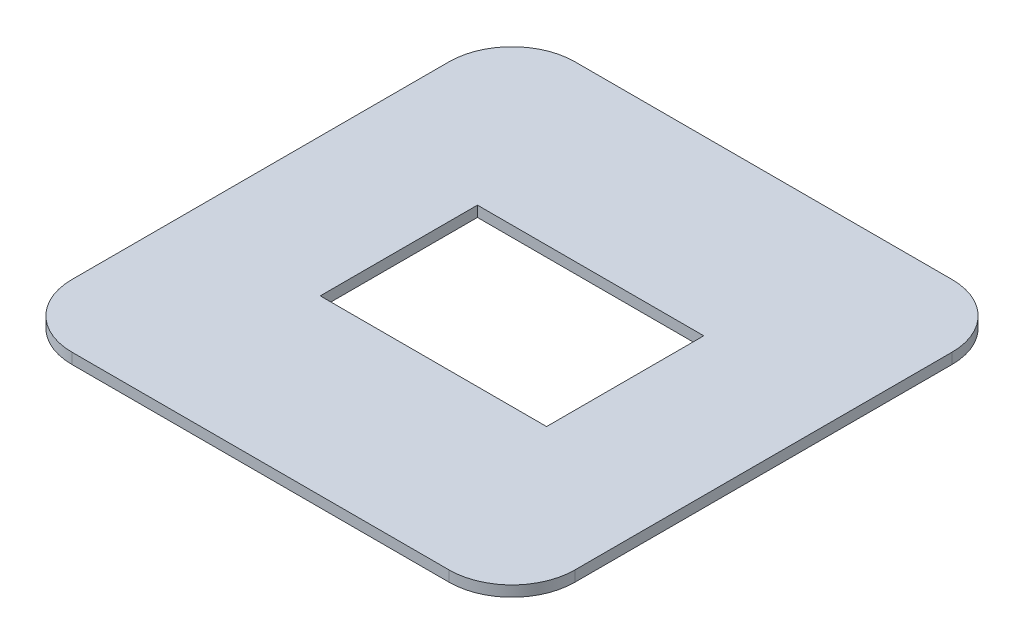
ISO-10303-21;
HEADER;
FILE_DESCRIPTION(('STEP AP214'),'2;1');
FILE_NAME('part.step','',(''),(''),'','','');
FILE_SCHEMA(('AUTOMOTIVE_DESIGN { 1 0 10303 214 1 1 1 1 }'));
ENDSEC;
DATA;
#1=APPLICATION_CONTEXT('core data for automotive mechanical design processes');
#2=APPLICATION_PROTOCOL_DEFINITION('international standard','automotive_design',2000,#1);
#3=PRODUCT_CONTEXT('',#1,'mechanical');
#4=PRODUCT('Part','Part','',(#3));
#5=PRODUCT_RELATED_PRODUCT_CATEGORY('part','',(#4));
#6=PRODUCT_DEFINITION_FORMATION('','',#4);
#7=PRODUCT_DEFINITION_CONTEXT('part definition',#1,'design');
#8=PRODUCT_DEFINITION('design','',#6,#7);
#9=PRODUCT_DEFINITION_SHAPE('','',#8);
#10=(LENGTH_UNIT() NAMED_UNIT(*) SI_UNIT(.MILLI.,.METRE.));
#11=(NAMED_UNIT(*) PLANE_ANGLE_UNIT() SI_UNIT($,.RADIAN.));
#12=(NAMED_UNIT(*) SI_UNIT($,.STERADIAN.) SOLID_ANGLE_UNIT());
#13=UNCERTAINTY_MEASURE_WITH_UNIT(LENGTH_MEASURE(1.E-05),#10,'distance_accuracy_value','');
#14=(GEOMETRIC_REPRESENTATION_CONTEXT(3) GLOBAL_UNCERTAINTY_ASSIGNED_CONTEXT((#13)) GLOBAL_UNIT_ASSIGNED_CONTEXT((#10,
#11,#12)) REPRESENTATION_CONTEXT('',''));
#15=CARTESIAN_POINT('',(0.,0.,0.));
#16=DIRECTION('',(0.,0.,1.));
#17=DIRECTION('',(1.,0.,0.));
#18=AXIS2_PLACEMENT_3D('',#15,#16,#17);
#19=CARTESIAN_POINT('',(-40.,1.7,-40.));
#20=DIRECTION('',(0.,0.,-1.));
#21=DIRECTION('',(-1.,0.,0.));
#22=AXIS2_PLACEMENT_3D('',#19,#20,#21);
#23=PLANE('',#22);
#24=DIRECTION('',(1.,0.,0.));
#25=VECTOR('',#24,1.);
#26=CARTESIAN_POINT('',(-40.,0.,-40.));
#27=LINE('',#26,#25);
#28=CARTESIAN_POINT('',(-30.,0.,-40.));
#29=VERTEX_POINT('',#28);
#30=CARTESIAN_POINT('',(30.,0.,-40.));
#31=VERTEX_POINT('',#30);
#32=EDGE_CURVE('E207',#29,#31,#27,.T.);
#33=ORIENTED_EDGE('',*,*,#32,.F.);
#34=DIRECTION('',(0.,-1.,0.));
#35=VECTOR('',#34,1.);
#36=CARTESIAN_POINT('',(-30.,1.7,-40.));
#37=LINE('',#36,#35);
#38=CARTESIAN_POINT('',(-30.,1.7,-40.));
#39=VERTEX_POINT('',#38);
#40=EDGE_CURVE('E264',#29,#39,#37,.F.);
#41=ORIENTED_EDGE('',*,*,#40,.T.);
#42=DIRECTION('',(1.,0.,0.));
#43=VECTOR('',#42,1.);
#44=CARTESIAN_POINT('',(-40.,1.7,-40.));
#45=LINE('',#44,#43);
#46=CARTESIAN_POINT('',(30.,1.7,-40.));
#47=VERTEX_POINT('',#46);
#48=EDGE_CURVE('E213',#39,#47,#45,.T.);
#49=ORIENTED_EDGE('',*,*,#48,.T.);
#50=DIRECTION('',(0.,-1.,0.));
#51=VECTOR('',#50,1.);
#52=CARTESIAN_POINT('',(30.,0.,-40.));
#53=LINE('',#52,#51);
#54=EDGE_CURVE('E260',#47,#31,#53,.T.);
#55=ORIENTED_EDGE('',*,*,#54,.T.);
#56=EDGE_LOOP('',(#33,#41,#49,#55));
#57=FACE_BOUND('',#56,.T.);
#58=ADVANCED_FACE('F67',(#57),#23,.T.);
#59=CARTESIAN_POINT('',(-40.,1.7,40.));
#60=DIRECTION('',(-1.,0.,0.));
#61=DIRECTION('',(0.,0.,1.));
#62=AXIS2_PLACEMENT_3D('',#59,#60,#61);
#63=PLANE('',#62);
#64=DIRECTION('',(0.,0.,-1.));
#65=VECTOR('',#64,1.);
#66=CARTESIAN_POINT('',(-40.,1.7,40.));
#67=LINE('',#66,#65);
#68=CARTESIAN_POINT('',(-40.,1.7,30.));
#69=VERTEX_POINT('',#68);
#70=CARTESIAN_POINT('',(-40.,1.7,-30.));
#71=VERTEX_POINT('',#70);
#72=EDGE_CURVE('E224',#69,#71,#67,.T.);
#73=ORIENTED_EDGE('',*,*,#72,.T.);
#74=DIRECTION('',(0.,-1.,0.));
#75=VECTOR('',#74,1.);
#76=CARTESIAN_POINT('',(-40.,1.7,-30.));
#77=LINE('',#76,#75);
#78=CARTESIAN_POINT('',(-40.,0.,-30.));
#79=VERTEX_POINT('',#78);
#80=EDGE_CURVE('E244',#71,#79,#77,.T.);
#81=ORIENTED_EDGE('',*,*,#80,.T.);
#82=DIRECTION('',(0.,0.,-1.));
#83=VECTOR('',#82,1.);
#84=CARTESIAN_POINT('',(-40.,0.,40.));
#85=LINE('',#84,#83);
#86=CARTESIAN_POINT('',(-40.,0.,30.));
#87=VERTEX_POINT('',#86);
#88=EDGE_CURVE('E218',#87,#79,#85,.T.);
#89=ORIENTED_EDGE('',*,*,#88,.F.);
#90=DIRECTION('',(0.,-1.,0.));
#91=VECTOR('',#90,1.);
#92=CARTESIAN_POINT('',(-40.,1.7,30.));
#93=LINE('',#92,#91);
#94=EDGE_CURVE('E228',#87,#69,#93,.F.);
#95=ORIENTED_EDGE('',*,*,#94,.T.);
#96=EDGE_LOOP('',(#73,#81,#89,#95));
#97=FACE_BOUND('',#96,.T.);
#98=ADVANCED_FACE('F314',(#97),#63,.T.);
#99=CARTESIAN_POINT('',(-40.,1.7,40.));
#100=DIRECTION('',(0.,0.,-1.));
#101=DIRECTION('',(-1.,0.,0.));
#102=AXIS2_PLACEMENT_3D('',#99,#100,#101);
#103=PLANE('',#102);
#104=DIRECTION('',(1.,0.,0.));
#105=VECTOR('',#104,1.);
#106=CARTESIAN_POINT('',(-40.,0.,40.));
#107=LINE('',#106,#105);
#108=CARTESIAN_POINT('',(-30.,0.,40.));
#109=VERTEX_POINT('',#108);
#110=CARTESIAN_POINT('',(30.,0.,40.));
#111=VERTEX_POINT('',#110);
#112=EDGE_CURVE('E235',#109,#111,#107,.T.);
#113=ORIENTED_EDGE('',*,*,#112,.T.);
#114=DIRECTION('',(0.,-1.,0.));
#115=VECTOR('',#114,1.);
#116=CARTESIAN_POINT('',(30.,1.7,40.));
#117=LINE('',#116,#115);
#118=CARTESIAN_POINT('',(30.,1.7,40.));
#119=VERTEX_POINT('',#118);
#120=EDGE_CURVE('E12',#111,#119,#117,.F.);
#121=ORIENTED_EDGE('',*,*,#120,.T.);
#122=DIRECTION('',(1.,0.,0.));
#123=VECTOR('',#122,1.);
#124=CARTESIAN_POINT('',(-40.,1.7,40.));
#125=LINE('',#124,#123);
#126=CARTESIAN_POINT('',(-30.,1.7,40.));
#127=VERTEX_POINT('',#126);
#128=EDGE_CURVE('E221',#127,#119,#125,.T.);
#129=ORIENTED_EDGE('',*,*,#128,.F.);
#130=DIRECTION('',(0.,-1.,0.));
#131=VECTOR('',#130,1.);
#132=CARTESIAN_POINT('',(-30.,0.,40.));
#133=LINE('',#132,#131);
#134=EDGE_CURVE('E76',#127,#109,#133,.T.);
#135=ORIENTED_EDGE('',*,*,#134,.T.);
#136=EDGE_LOOP('',(#113,#121,#129,#135));
#137=FACE_BOUND('',#136,.T.);
#138=ADVANCED_FACE('F289',(#137),#103,.F.);
#139=CARTESIAN_POINT('',(40.,1.7,40.));
#140=DIRECTION('',(-1.,0.,0.));
#141=DIRECTION('',(0.,0.,1.));
#142=AXIS2_PLACEMENT_3D('',#139,#140,#141);
#143=PLANE('',#142);
#144=DIRECTION('',(0.,0.,-1.));
#145=VECTOR('',#144,1.);
#146=CARTESIAN_POINT('',(40.,0.,40.));
#147=LINE('',#146,#145);
#148=CARTESIAN_POINT('',(40.,0.,30.));
#149=VERTEX_POINT('',#148);
#150=CARTESIAN_POINT('',(40.,0.,-30.));
#151=VERTEX_POINT('',#150);
#152=EDGE_CURVE('E232',#149,#151,#147,.T.);
#153=ORIENTED_EDGE('',*,*,#152,.T.);
#154=DIRECTION('',(0.,-1.,0.));
#155=VECTOR('',#154,1.);
#156=CARTESIAN_POINT('',(40.,1.7,-30.));
#157=LINE('',#156,#155);
#158=CARTESIAN_POINT('',(40.,1.7,-30.));
#159=VERTEX_POINT('',#158);
#160=EDGE_CURVE('E83',#151,#159,#157,.F.);
#161=ORIENTED_EDGE('',*,*,#160,.T.);
#162=DIRECTION('',(0.,0.,-1.));
#163=VECTOR('',#162,1.);
#164=CARTESIAN_POINT('',(40.,1.7,40.));
#165=LINE('',#164,#163);
#166=CARTESIAN_POINT('',(40.,1.7,30.));
#167=VERTEX_POINT('',#166);
#168=EDGE_CURVE('E217',#167,#159,#165,.T.);
#169=ORIENTED_EDGE('',*,*,#168,.F.);
#170=DIRECTION('',(0.,-1.,0.));
#171=VECTOR('',#170,1.);
#172=CARTESIAN_POINT('',(40.,1.7,30.));
#173=LINE('',#172,#171);
#174=EDGE_CURVE('E278',#167,#149,#173,.T.);
#175=ORIENTED_EDGE('',*,*,#174,.T.);
#176=EDGE_LOOP('',(#153,#161,#169,#175));
#177=FACE_BOUND('',#176,.T.);
#178=ADVANCED_FACE('F300',(#177),#143,.F.);
#179=CARTESIAN_POINT('',(0.,1.7,0.));
#180=DIRECTION('',(0.,1.,0.));
#181=DIRECTION('',(0.,0.,1.));
#182=AXIS2_PLACEMENT_3D('',#179,#180,#181);
#183=PLANE('',#182);
#184=DIRECTION('',(-1.,0.,0.));
#185=VECTOR('',#184,1.);
#186=CARTESIAN_POINT('',(18.,1.7,12.5));
#187=LINE('',#186,#185);
#188=CARTESIAN_POINT('',(18.,1.7,12.5));
#189=VERTEX_POINT('',#188);
#190=CARTESIAN_POINT('',(-18.,1.7,12.5));
#191=VERTEX_POINT('',#190);
#192=EDGE_CURVE('E171',#189,#191,#187,.T.);
#193=ORIENTED_EDGE('',*,*,#192,.T.);
#194=DIRECTION('',(0.,0.,1.));
#195=VECTOR('',#194,1.);
#196=CARTESIAN_POINT('',(-18.,1.7,-12.5));
#197=LINE('',#196,#195);
#198=CARTESIAN_POINT('',(-18.,1.7,-12.5));
#199=VERTEX_POINT('',#198);
#200=EDGE_CURVE('E158',#199,#191,#197,.T.);
#201=ORIENTED_EDGE('',*,*,#200,.F.);
#202=DIRECTION('',(-1.,0.,0.));
#203=VECTOR('',#202,1.);
#204=CARTESIAN_POINT('',(18.,1.7,-12.5));
#205=LINE('',#204,#203);
#206=CARTESIAN_POINT('',(18.,1.7,-12.5));
#207=VERTEX_POINT('',#206);
#208=EDGE_CURVE('E170',#207,#199,#205,.T.);
#209=ORIENTED_EDGE('',*,*,#208,.F.);
#210=DIRECTION('',(0.,0.,1.));
#211=VECTOR('',#210,1.);
#212=CARTESIAN_POINT('',(18.,1.7,-12.5));
#213=LINE('',#212,#211);
#214=EDGE_CURVE('E180',#207,#189,#213,.T.);
#215=ORIENTED_EDGE('',*,*,#214,.T.);
#216=EDGE_LOOP('',(#193,#201,#209,#215));
#217=FACE_BOUND('',#216,.T.);
#218=ORIENTED_EDGE('',*,*,#48,.F.);
#219=CARTESIAN_POINT('',(-30.,1.7,-30.));
#220=DIRECTION('',(0.,1.,0.));
#221=DIRECTION('',(0.,0.,1.));
#222=AXIS2_PLACEMENT_3D('',#219,#220,#221);
#223=CIRCLE('',#222,10.);
#224=EDGE_CURVE('E275',#39,#71,#223,.T.);
#225=ORIENTED_EDGE('',*,*,#224,.T.);
#226=ORIENTED_EDGE('',*,*,#72,.F.);
#227=CARTESIAN_POINT('',(-30.,1.7,30.));
#228=DIRECTION('',(0.,1.,0.));
#229=DIRECTION('',(0.,0.,1.));
#230=AXIS2_PLACEMENT_3D('',#227,#228,#229);
#231=CIRCLE('',#230,10.);
#232=EDGE_CURVE('E267',#69,#127,#231,.T.);
#233=ORIENTED_EDGE('',*,*,#232,.T.);
#234=ORIENTED_EDGE('',*,*,#128,.T.);
#235=CARTESIAN_POINT('',(30.,1.7,30.));
#236=DIRECTION('',(0.,1.,0.));
#237=DIRECTION('',(0.,0.,1.));
#238=AXIS2_PLACEMENT_3D('',#235,#236,#237);
#239=CIRCLE('',#238,10.);
#240=EDGE_CURVE('E90',#119,#167,#239,.T.);
#241=ORIENTED_EDGE('',*,*,#240,.T.);
#242=ORIENTED_EDGE('',*,*,#168,.T.);
#243=CARTESIAN_POINT('',(30.,1.7,-30.));
#244=DIRECTION('',(0.,1.,0.));
#245=DIRECTION('',(0.,0.,1.));
#246=AXIS2_PLACEMENT_3D('',#243,#244,#245);
#247=CIRCLE('',#246,10.);
#248=EDGE_CURVE('E272',#159,#47,#247,.T.);
#249=ORIENTED_EDGE('',*,*,#248,.T.);
#250=EDGE_LOOP('',(#218,#225,#226,#233,#234,#241,#242,#249));
#251=FACE_BOUND('',#250,.T.);
#252=ADVANCED_FACE('F182',(#217,#251),#183,.T.);
#253=CARTESIAN_POINT('',(0.,0.,0.));
#254=DIRECTION('',(0.,1.,0.));
#255=DIRECTION('',(0.,0.,1.));
#256=AXIS2_PLACEMENT_3D('',#253,#254,#255);
#257=PLANE('',#256);
#258=DIRECTION('',(0.,0.,1.));
#259=VECTOR('',#258,1.);
#260=CARTESIAN_POINT('',(-18.,0.,-12.5));
#261=LINE('',#260,#259);
#262=CARTESIAN_POINT('',(-18.,0.,-12.5));
#263=VERTEX_POINT('',#262);
#264=CARTESIAN_POINT('',(-18.,0.,12.5));
#265=VERTEX_POINT('',#264);
#266=EDGE_CURVE('E198',#263,#265,#261,.T.);
#267=ORIENTED_EDGE('',*,*,#266,.T.);
#268=DIRECTION('',(-1.,0.,0.));
#269=VECTOR('',#268,1.);
#270=CARTESIAN_POINT('',(18.,0.,12.5));
#271=LINE('',#270,#269);
#272=CARTESIAN_POINT('',(18.,0.,12.5));
#273=VERTEX_POINT('',#272);
#274=EDGE_CURVE('E178',#273,#265,#271,.T.);
#275=ORIENTED_EDGE('',*,*,#274,.F.);
#276=DIRECTION('',(0.,0.,1.));
#277=VECTOR('',#276,1.);
#278=CARTESIAN_POINT('',(18.,0.,-12.5));
#279=LINE('',#278,#277);
#280=CARTESIAN_POINT('',(18.,0.,-12.5));
#281=VERTEX_POINT('',#280);
#282=EDGE_CURVE('E185',#281,#273,#279,.T.);
#283=ORIENTED_EDGE('',*,*,#282,.F.);
#284=DIRECTION('',(-1.,0.,0.));
#285=VECTOR('',#284,1.);
#286=CARTESIAN_POINT('',(18.,0.,-12.5));
#287=LINE('',#286,#285);
#288=EDGE_CURVE('E189',#281,#263,#287,.T.);
#289=ORIENTED_EDGE('',*,*,#288,.T.);
#290=EDGE_LOOP('',(#267,#275,#283,#289));
#291=FACE_BOUND('',#290,.T.);
#292=ORIENTED_EDGE('',*,*,#88,.T.);
#293=CARTESIAN_POINT('',(-30.,0.,-30.));
#294=DIRECTION('',(0.,1.,0.));
#295=DIRECTION('',(0.,0.,1.));
#296=AXIS2_PLACEMENT_3D('',#293,#294,#295);
#297=CIRCLE('',#296,10.);
#298=EDGE_CURVE('E257',#79,#29,#297,.F.);
#299=ORIENTED_EDGE('',*,*,#298,.T.);
#300=ORIENTED_EDGE('',*,*,#32,.T.);
#301=CARTESIAN_POINT('',(30.,0.,-30.));
#302=DIRECTION('',(0.,1.,0.));
#303=DIRECTION('',(0.,0.,1.));
#304=AXIS2_PLACEMENT_3D('',#301,#302,#303);
#305=CIRCLE('',#304,10.);
#306=EDGE_CURVE('E254',#31,#151,#305,.F.);
#307=ORIENTED_EDGE('',*,*,#306,.T.);
#308=ORIENTED_EDGE('',*,*,#152,.F.);
#309=CARTESIAN_POINT('',(30.,0.,30.));
#310=DIRECTION('',(0.,1.,0.));
#311=DIRECTION('',(0.,0.,1.));
#312=AXIS2_PLACEMENT_3D('',#309,#310,#311);
#313=CIRCLE('',#312,10.);
#314=EDGE_CURVE('E251',#149,#111,#313,.F.);
#315=ORIENTED_EDGE('',*,*,#314,.T.);
#316=ORIENTED_EDGE('',*,*,#112,.F.);
#317=CARTESIAN_POINT('',(-30.,0.,30.));
#318=DIRECTION('',(0.,1.,0.));
#319=DIRECTION('',(0.,0.,1.));
#320=AXIS2_PLACEMENT_3D('',#317,#318,#319);
#321=CIRCLE('',#320,10.);
#322=EDGE_CURVE('E248',#109,#87,#321,.F.);
#323=ORIENTED_EDGE('',*,*,#322,.T.);
#324=EDGE_LOOP('',(#292,#299,#300,#307,#308,#315,#316,#323));
#325=FACE_BOUND('',#324,.T.);
#326=ADVANCED_FACE('F294',(#291,#325),#257,.F.);
#327=CARTESIAN_POINT('',(18.,1.7,12.5));
#328=DIRECTION('',(0.,0.,1.));
#329=DIRECTION('',(1.,0.,0.));
#330=AXIS2_PLACEMENT_3D('',#327,#328,#329);
#331=PLANE('',#330);
#332=ORIENTED_EDGE('',*,*,#274,.T.);
#333=DIRECTION('',(0.,-1.,0.));
#334=VECTOR('',#333,1.);
#335=CARTESIAN_POINT('',(-18.,1.7,12.5));
#336=LINE('',#335,#334);
#337=EDGE_CURVE('E162',#191,#265,#336,.T.);
#338=ORIENTED_EDGE('',*,*,#337,.F.);
#339=ORIENTED_EDGE('',*,*,#192,.F.);
#340=DIRECTION('',(0.,-1.,0.));
#341=VECTOR('',#340,1.);
#342=CARTESIAN_POINT('',(18.,1.7,12.5));
#343=LINE('',#342,#341);
#344=EDGE_CURVE('E204',#189,#273,#343,.T.);
#345=ORIENTED_EDGE('',*,*,#344,.T.);
#346=EDGE_LOOP('',(#332,#338,#339,#345));
#347=FACE_BOUND('',#346,.T.);
#348=ADVANCED_FACE('F175',(#347),#331,.F.);
#349=CARTESIAN_POINT('',(18.,1.7,-12.5));
#350=DIRECTION('',(1.,0.,0.));
#351=DIRECTION('',(0.,0.,-1.));
#352=AXIS2_PLACEMENT_3D('',#349,#350,#351);
#353=PLANE('',#352);
#354=ORIENTED_EDGE('',*,*,#282,.T.);
#355=ORIENTED_EDGE('',*,*,#344,.F.);
#356=ORIENTED_EDGE('',*,*,#214,.F.);
#357=DIRECTION('',(0.,-1.,0.));
#358=VECTOR('',#357,1.);
#359=CARTESIAN_POINT('',(18.,1.7,-12.5));
#360=LINE('',#359,#358);
#361=EDGE_CURVE('E208',#207,#281,#360,.T.);
#362=ORIENTED_EDGE('',*,*,#361,.T.);
#363=EDGE_LOOP('',(#354,#355,#356,#362));
#364=FACE_BOUND('',#363,.T.);
#365=ADVANCED_FACE('F376',(#364),#353,.F.);
#366=CARTESIAN_POINT('',(18.,1.7,-12.5));
#367=DIRECTION('',(0.,0.,1.));
#368=DIRECTION('',(1.,0.,0.));
#369=AXIS2_PLACEMENT_3D('',#366,#367,#368);
#370=PLANE('',#369);
#371=ORIENTED_EDGE('',*,*,#288,.F.);
#372=ORIENTED_EDGE('',*,*,#361,.F.);
#373=ORIENTED_EDGE('',*,*,#208,.T.);
#374=DIRECTION('',(0.,-1.,0.));
#375=VECTOR('',#374,1.);
#376=CARTESIAN_POINT('',(-18.,1.7,-12.5));
#377=LINE('',#376,#375);
#378=EDGE_CURVE('E164',#199,#263,#377,.T.);
#379=ORIENTED_EDGE('',*,*,#378,.T.);
#380=EDGE_LOOP('',(#371,#372,#373,#379));
#381=FACE_BOUND('',#380,.T.);
#382=ADVANCED_FACE('F367',(#381),#370,.T.);
#383=CARTESIAN_POINT('',(-18.,1.7,-12.5));
#384=DIRECTION('',(1.,0.,0.));
#385=DIRECTION('',(0.,0.,-1.));
#386=AXIS2_PLACEMENT_3D('',#383,#384,#385);
#387=PLANE('',#386);
#388=ORIENTED_EDGE('',*,*,#266,.F.);
#389=ORIENTED_EDGE('',*,*,#378,.F.);
#390=ORIENTED_EDGE('',*,*,#200,.T.);
#391=ORIENTED_EDGE('',*,*,#337,.T.);
#392=EDGE_LOOP('',(#388,#389,#390,#391));
#393=FACE_BOUND('',#392,.T.);
#394=ADVANCED_FACE('F161',(#393),#387,.T.);
#395=CARTESIAN_POINT('',(-30.,1.7,-30.));
#396=DIRECTION('',(0.,-1.,0.));
#397=DIRECTION('',(0.,0.,-1.));
#398=AXIS2_PLACEMENT_3D('',#395,#396,#397);
#399=CYLINDRICAL_SURFACE('',#398,10.);
#400=ORIENTED_EDGE('',*,*,#224,.F.);
#401=ORIENTED_EDGE('',*,*,#40,.F.);
#402=ORIENTED_EDGE('',*,*,#298,.F.);
#403=ORIENTED_EDGE('',*,*,#80,.F.);
#404=EDGE_LOOP('',(#400,#401,#402,#403));
#405=FACE_BOUND('',#404,.T.);
#406=ADVANCED_FACE('F312',(#405),#399,.T.);
#407=CARTESIAN_POINT('',(30.,1.7,-30.));
#408=DIRECTION('',(0.,1.,0.));
#409=DIRECTION('',(0.,0.,1.));
#410=AXIS2_PLACEMENT_3D('',#407,#408,#409);
#411=CYLINDRICAL_SURFACE('',#410,10.);
#412=ORIENTED_EDGE('',*,*,#248,.F.);
#413=ORIENTED_EDGE('',*,*,#160,.F.);
#414=ORIENTED_EDGE('',*,*,#306,.F.);
#415=ORIENTED_EDGE('',*,*,#54,.F.);
#416=EDGE_LOOP('',(#412,#413,#414,#415));
#417=FACE_BOUND('',#416,.T.);
#418=ADVANCED_FACE('F305',(#417),#411,.T.);
#419=CARTESIAN_POINT('',(30.,1.7,30.));
#420=DIRECTION('',(0.,-1.,0.));
#421=DIRECTION('',(0.,0.,-1.));
#422=AXIS2_PLACEMENT_3D('',#419,#420,#421);
#423=CYLINDRICAL_SURFACE('',#422,10.);
#424=ORIENTED_EDGE('',*,*,#240,.F.);
#425=ORIENTED_EDGE('',*,*,#120,.F.);
#426=ORIENTED_EDGE('',*,*,#314,.F.);
#427=ORIENTED_EDGE('',*,*,#174,.F.);
#428=EDGE_LOOP('',(#424,#425,#426,#427));
#429=FACE_BOUND('',#428,.T.);
#430=ADVANCED_FACE('F299',(#429),#423,.T.);
#431=CARTESIAN_POINT('',(-30.,1.7,30.));
#432=DIRECTION('',(0.,1.,0.));
#433=DIRECTION('',(0.,0.,1.));
#434=AXIS2_PLACEMENT_3D('',#431,#432,#433);
#435=CYLINDRICAL_SURFACE('',#434,10.);
#436=ORIENTED_EDGE('',*,*,#232,.F.);
#437=ORIENTED_EDGE('',*,*,#94,.F.);
#438=ORIENTED_EDGE('',*,*,#322,.F.);
#439=ORIENTED_EDGE('',*,*,#134,.F.);
#440=EDGE_LOOP('',(#436,#437,#438,#439));
#441=FACE_BOUND('',#440,.T.);
#442=ADVANCED_FACE('F69',(#441),#435,.T.);
#443=CLOSED_SHELL('',(#58,#98,#138,#178,#252,#326,#348,#365,#382,#394,#406,#418,#430,#442));
#444=MANIFOLD_SOLID_BREP('B2',#443);
#445=ADVANCED_BREP_SHAPE_REPRESENTATION('',(#18,#444),#14);
#446=SHAPE_DEFINITION_REPRESENTATION(#9,#445);
ENDSEC;
END-ISO-10303-21;
